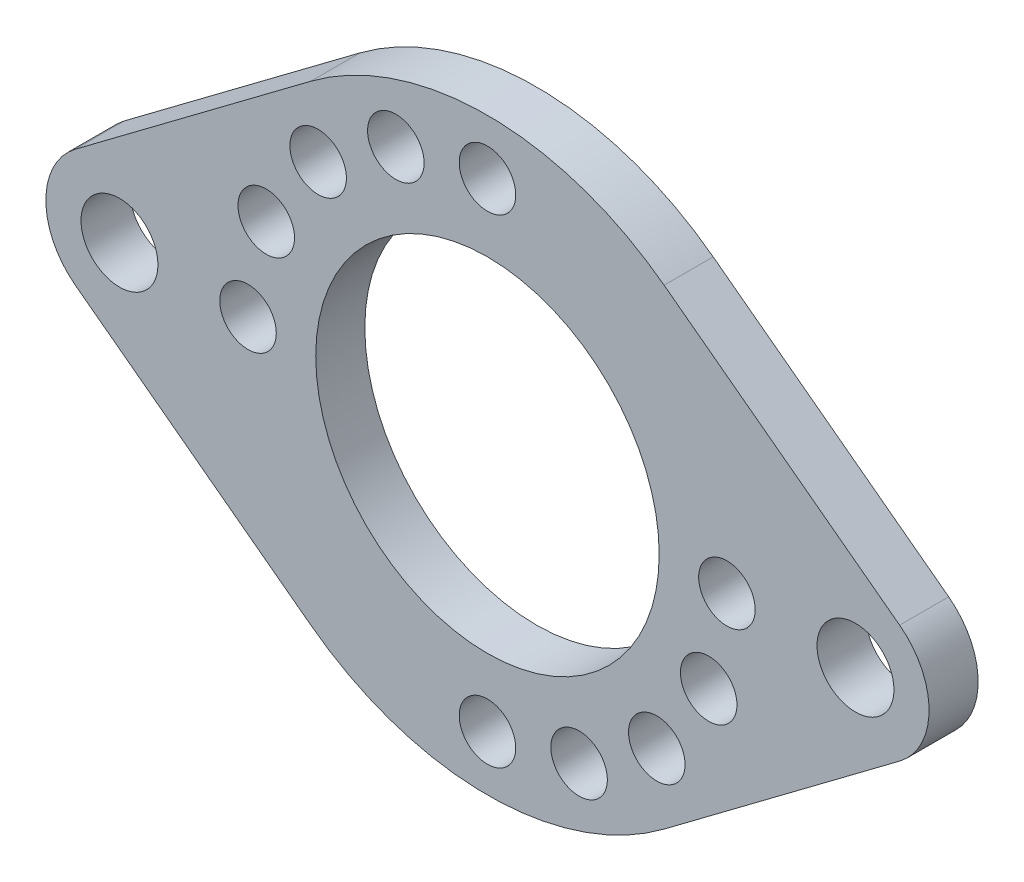
ISO-10303-21;
HEADER;
FILE_DESCRIPTION(('STEP AP214'),'2;1');
FILE_NAME('part.step','',(''),(''),'','','');
FILE_SCHEMA(('AUTOMOTIVE_DESIGN { 1 0 10303 214 1 1 1 1 }'));
ENDSEC;
DATA;
#1=APPLICATION_CONTEXT('core data for automotive mechanical design processes');
#2=APPLICATION_PROTOCOL_DEFINITION('international standard','automotive_design',2000,#1);
#3=PRODUCT_CONTEXT('',#1,'mechanical');
#4=PRODUCT('Part','Part','',(#3));
#5=PRODUCT_RELATED_PRODUCT_CATEGORY('part','',(#4));
#6=PRODUCT_DEFINITION_FORMATION('','',#4);
#7=PRODUCT_DEFINITION_CONTEXT('part definition',#1,'design');
#8=PRODUCT_DEFINITION('design','',#6,#7);
#9=PRODUCT_DEFINITION_SHAPE('','',#8);
#10=(LENGTH_UNIT() NAMED_UNIT(*) SI_UNIT(.MILLI.,.METRE.));
#11=(NAMED_UNIT(*) PLANE_ANGLE_UNIT() SI_UNIT($,.RADIAN.));
#12=(NAMED_UNIT(*) SI_UNIT($,.STERADIAN.) SOLID_ANGLE_UNIT());
#13=UNCERTAINTY_MEASURE_WITH_UNIT(LENGTH_MEASURE(1.E-05),#10,'distance_accuracy_value','');
#14=(GEOMETRIC_REPRESENTATION_CONTEXT(3) GLOBAL_UNCERTAINTY_ASSIGNED_CONTEXT((#13)) GLOBAL_UNIT_ASSIGNED_CONTEXT((#10,
#11,#12)) REPRESENTATION_CONTEXT('',''));
#15=CARTESIAN_POINT('',(0.,0.,0.));
#16=DIRECTION('',(0.,0.,1.));
#17=DIRECTION('',(1.,0.,0.));
#18=AXIS2_PLACEMENT_3D('',#15,#16,#17);
#19=CARTESIAN_POINT('',(0.,0.,-1.5875));
#20=DIRECTION('',(0.,0.,1.));
#21=DIRECTION('',(1.,0.,0.));
#22=AXIS2_PLACEMENT_3D('',#19,#20,#21);
#23=PLANE('',#22);
#24=CARTESIAN_POINT('',(0.,0.,-1.5875));
#25=DIRECTION('',(0.,0.,-1.));
#26=DIRECTION('',(-1.,0.,0.));
#27=AXIS2_PLACEMENT_3D('',#24,#25,#26);
#28=CIRCLE('',#27,11.1125);
#29=CARTESIAN_POINT('',(-11.1125,0.,-1.5875));
#30=VERTEX_POINT('',#29);
#31=EDGE_CURVE('E168',#30,#30,#28,.F.);
#32=ORIENTED_EDGE('',*,*,#31,.T.);
#33=EDGE_LOOP('',(#32));
#34=FACE_BOUND('',#33,.T.);
#35=CARTESIAN_POINT('',(-23.8125,0.,-1.5875));
#36=DIRECTION('',(0.,0.,-1.));
#37=DIRECTION('',(-1.,0.,0.));
#38=AXIS2_PLACEMENT_3D('',#35,#36,#37);
#39=CIRCLE('',#38,4.7625);
#40=CARTESIAN_POINT('',(-26.67,3.81,-1.5875));
#41=VERTEX_POINT('',#40);
#42=CARTESIAN_POINT('',(-26.67,-3.81,-1.5875));
#43=VERTEX_POINT('',#42);
#44=EDGE_CURVE('E172',#41,#43,#39,.F.);
#45=ORIENTED_EDGE('',*,*,#44,.F.);
#46=DIRECTION('',(-0.8,-0.6,0.));
#47=VECTOR('',#46,1.);
#48=CARTESIAN_POINT('',(-11.43,15.24,-1.5875));
#49=LINE('',#48,#47);
#50=CARTESIAN_POINT('',(-11.43,15.24,-1.5875));
#51=VERTEX_POINT('',#50);
#52=EDGE_CURVE('E111',#51,#41,#49,.T.);
#53=ORIENTED_EDGE('',*,*,#52,.F.);
#54=CARTESIAN_POINT('',(0.,0.,-1.5875));
#55=DIRECTION('',(0.,0.,-1.));
#56=DIRECTION('',(-1.,0.,0.));
#57=AXIS2_PLACEMENT_3D('',#54,#55,#56);
#58=CIRCLE('',#57,19.05);
#59=CARTESIAN_POINT('',(11.43,15.24,-1.5875));
#60=VERTEX_POINT('',#59);
#61=EDGE_CURVE('E116',#60,#51,#58,.F.);
#62=ORIENTED_EDGE('',*,*,#61,.F.);
#63=DIRECTION('',(0.8,-0.6,0.));
#64=VECTOR('',#63,1.);
#65=CARTESIAN_POINT('',(11.43,15.24,-1.5875));
#66=LINE('',#65,#64);
#67=CARTESIAN_POINT('',(26.67,3.81,-1.5875));
#68=VERTEX_POINT('',#67);
#69=EDGE_CURVE('E115',#60,#68,#66,.T.);
#70=ORIENTED_EDGE('',*,*,#69,.T.);
#71=CARTESIAN_POINT('',(23.8125,0.,-1.5875));
#72=DIRECTION('',(0.,0.,-1.));
#73=DIRECTION('',(-1.,0.,0.));
#74=AXIS2_PLACEMENT_3D('',#71,#72,#73);
#75=CIRCLE('',#74,4.7625);
#76=CARTESIAN_POINT('',(26.67,-3.81,-1.5875));
#77=VERTEX_POINT('',#76);
#78=EDGE_CURVE('E95',#77,#68,#75,.F.);
#79=ORIENTED_EDGE('',*,*,#78,.F.);
#80=DIRECTION('',(-0.8,-0.6,0.));
#81=VECTOR('',#80,1.);
#82=CARTESIAN_POINT('',(11.43,-15.24,-1.5875));
#83=LINE('',#82,#81);
#84=CARTESIAN_POINT('',(11.43,-15.24,-1.5875));
#85=VERTEX_POINT('',#84);
#86=EDGE_CURVE('E92',#77,#85,#83,.T.);
#87=ORIENTED_EDGE('',*,*,#86,.T.);
#88=CARTESIAN_POINT('',(0.,0.,-1.5875));
#89=DIRECTION('',(0.,0.,-1.));
#90=DIRECTION('',(-1.,0.,0.));
#91=AXIS2_PLACEMENT_3D('',#88,#89,#90);
#92=CIRCLE('',#91,19.05);
#93=CARTESIAN_POINT('',(-11.43,-15.24,-1.5875));
#94=VERTEX_POINT('',#93);
#95=EDGE_CURVE('E79',#94,#85,#92,.F.);
#96=ORIENTED_EDGE('',*,*,#95,.F.);
#97=DIRECTION('',(-0.8,0.6,0.));
#98=VECTOR('',#97,1.);
#99=CARTESIAN_POINT('',(-11.43,-15.24,-1.5875));
#100=LINE('',#99,#98);
#101=EDGE_CURVE('E89',#94,#43,#100,.T.);
#102=ORIENTED_EDGE('',*,*,#101,.T.);
#103=EDGE_LOOP('',(#45,#53,#62,#70,#79,#87,#96,#102));
#104=FACE_BOUND('',#103,.T.);
#105=CARTESIAN_POINT('',(0.,15.494,-1.5875));
#106=DIRECTION('',(0.,0.,1.));
#107=DIRECTION('',(1.,0.,0.));
#108=AXIS2_PLACEMENT_3D('',#105,#106,#107);
#109=CIRCLE('',#108,1.82879999999999);
#110=CARTESIAN_POINT('',(1.82879999999999,15.494,-1.5875));
#111=VERTEX_POINT('',#110);
#112=EDGE_CURVE('E110',#111,#111,#109,.T.);
#113=ORIENTED_EDGE('',*,*,#112,.T.);
#114=EDGE_LOOP('',(#113));
#115=FACE_BOUND('',#114,.T.);
#116=CARTESIAN_POINT('',(-15.494,0.,-1.5875));
#117=DIRECTION('',(0.,0.,1.));
#118=DIRECTION('',(1.,0.,0.));
#119=AXIS2_PLACEMENT_3D('',#116,#117,#118);
#120=CIRCLE('',#119,1.82879999999999);
#121=CARTESIAN_POINT('',(-13.6652,0.,-1.5875));
#122=VERTEX_POINT('',#121);
#123=EDGE_CURVE('E180',#122,#122,#120,.T.);
#124=ORIENTED_EDGE('',*,*,#123,.T.);
#125=EDGE_LOOP('',(#124));
#126=FACE_BOUND('',#125,.T.);
#127=CARTESIAN_POINT('',(-14.3145894767299,5.92929710106476,-1.5875));
#128=DIRECTION('',(0.,0.,1.));
#129=DIRECTION('',(1.,0.,0.));
#130=AXIS2_PLACEMENT_3D('',#127,#128,#129);
#131=CIRCLE('',#130,1.82879999999999);
#132=CARTESIAN_POINT('',(-12.4857894767299,5.92929710106476,-1.5875));
#133=VERTEX_POINT('',#132);
#134=EDGE_CURVE('E183',#133,#133,#131,.T.);
#135=ORIENTED_EDGE('',*,*,#134,.T.);
#136=EDGE_LOOP('',(#135));
#137=FACE_BOUND('',#136,.T.);
#138=CARTESIAN_POINT('',(-5.92929710106471,14.3145894767299,-1.5875));
#139=DIRECTION('',(0.,0.,1.));
#140=DIRECTION('',(1.,0.,0.));
#141=AXIS2_PLACEMENT_3D('',#138,#139,#140);
#142=CIRCLE('',#141,1.82879999999999);
#143=CARTESIAN_POINT('',(-4.10049710106472,14.3145894767299,-1.5875));
#144=VERTEX_POINT('',#143);
#145=EDGE_CURVE('E186',#144,#144,#142,.T.);
#146=ORIENTED_EDGE('',*,*,#145,.T.);
#147=EDGE_LOOP('',(#146));
#148=FACE_BOUND('',#147,.T.);
#149=CARTESIAN_POINT('',(-10.9559124677044,10.9559124677043,-1.5875));
#150=DIRECTION('',(0.,0.,1.));
#151=DIRECTION('',(1.,0.,0.));
#152=AXIS2_PLACEMENT_3D('',#149,#150,#151);
#153=CIRCLE('',#152,1.82879999999999);
#154=CARTESIAN_POINT('',(-9.1271124677044,10.9559124677043,-1.5875));
#155=VERTEX_POINT('',#154);
#156=EDGE_CURVE('E189',#155,#155,#153,.T.);
#157=ORIENTED_EDGE('',*,*,#156,.T.);
#158=EDGE_LOOP('',(#157));
#159=FACE_BOUND('',#158,.T.);
#160=CARTESIAN_POINT('',(0.,-15.494,-1.5875));
#161=DIRECTION('',(0.,0.,1.));
#162=DIRECTION('',(1.,0.,0.));
#163=AXIS2_PLACEMENT_3D('',#160,#161,#162);
#164=CIRCLE('',#163,1.82879999999999);
#165=CARTESIAN_POINT('',(1.82879999999999,-15.494,-1.5875));
#166=VERTEX_POINT('',#165);
#167=EDGE_CURVE('E192',#166,#166,#164,.T.);
#168=ORIENTED_EDGE('',*,*,#167,.T.);
#169=EDGE_LOOP('',(#168));
#170=FACE_BOUND('',#169,.T.);
#171=CARTESIAN_POINT('',(15.494,0.,-1.5875));
#172=DIRECTION('',(0.,0.,1.));
#173=DIRECTION('',(1.,0.,0.));
#174=AXIS2_PLACEMENT_3D('',#171,#172,#173);
#175=CIRCLE('',#174,1.82879999999999);
#176=CARTESIAN_POINT('',(17.3228,0.,-1.5875));
#177=VERTEX_POINT('',#176);
#178=EDGE_CURVE('E195',#177,#177,#175,.T.);
#179=ORIENTED_EDGE('',*,*,#178,.T.);
#180=EDGE_LOOP('',(#179));
#181=FACE_BOUND('',#180,.T.);
#182=CARTESIAN_POINT('',(14.3145894767299,-5.92929710106476,-1.5875));
#183=DIRECTION('',(0.,0.,1.));
#184=DIRECTION('',(1.,0.,0.));
#185=AXIS2_PLACEMENT_3D('',#182,#183,#184);
#186=CIRCLE('',#185,1.82879999999999);
#187=CARTESIAN_POINT('',(16.1433894767298,-5.92929710106476,-1.5875));
#188=VERTEX_POINT('',#187);
#189=EDGE_CURVE('E198',#188,#188,#186,.T.);
#190=ORIENTED_EDGE('',*,*,#189,.T.);
#191=EDGE_LOOP('',(#190));
#192=FACE_BOUND('',#191,.T.);
#193=CARTESIAN_POINT('',(5.92929710106471,-14.3145894767299,-1.5875));
#194=DIRECTION('',(0.,0.,1.));
#195=DIRECTION('',(1.,0.,0.));
#196=AXIS2_PLACEMENT_3D('',#193,#194,#195);
#197=CIRCLE('',#196,1.82879999999999);
#198=CARTESIAN_POINT('',(7.7580971010647,-14.3145894767299,-1.5875));
#199=VERTEX_POINT('',#198);
#200=EDGE_CURVE('E201',#199,#199,#197,.T.);
#201=ORIENTED_EDGE('',*,*,#200,.T.);
#202=EDGE_LOOP('',(#201));
#203=FACE_BOUND('',#202,.T.);
#204=CARTESIAN_POINT('',(10.9559124677044,-10.9559124677043,-1.5875));
#205=DIRECTION('',(0.,0.,1.));
#206=DIRECTION('',(1.,0.,0.));
#207=AXIS2_PLACEMENT_3D('',#204,#205,#206);
#208=CIRCLE('',#207,1.82879999999999);
#209=CARTESIAN_POINT('',(12.7847124677044,-10.9559124677043,-1.5875));
#210=VERTEX_POINT('',#209);
#211=EDGE_CURVE('E204',#210,#210,#208,.T.);
#212=ORIENTED_EDGE('',*,*,#211,.T.);
#213=EDGE_LOOP('',(#212));
#214=FACE_BOUND('',#213,.T.);
#215=CARTESIAN_POINT('',(-23.8125,0.,-1.5875));
#216=DIRECTION('',(0.,0.,1.));
#217=DIRECTION('',(1.,0.,0.));
#218=AXIS2_PLACEMENT_3D('',#215,#216,#217);
#219=CIRCLE('',#218,2.48919999999999);
#220=CARTESIAN_POINT('',(-21.3233,0.,-1.5875));
#221=VERTEX_POINT('',#220);
#222=EDGE_CURVE('E206',#221,#221,#219,.T.);
#223=ORIENTED_EDGE('',*,*,#222,.T.);
#224=EDGE_LOOP('',(#223));
#225=FACE_BOUND('',#224,.T.);
#226=CARTESIAN_POINT('',(23.8125,0.,-1.5875));
#227=DIRECTION('',(0.,0.,1.));
#228=DIRECTION('',(1.,0.,0.));
#229=AXIS2_PLACEMENT_3D('',#226,#227,#228);
#230=CIRCLE('',#229,2.48919999999999);
#231=CARTESIAN_POINT('',(26.3017,0.,-1.5875));
#232=VERTEX_POINT('',#231);
#233=EDGE_CURVE('E20',#232,#232,#230,.T.);
#234=ORIENTED_EDGE('',*,*,#233,.T.);
#235=EDGE_LOOP('',(#234));
#236=FACE_BOUND('',#235,.T.);
#237=ADVANCED_FACE('F17',(#34,#104,#115,#126,#137,#148,#159,#170,#181,#192,#203,#214,#225,#236),
#23,.F.);
#238=CARTESIAN_POINT('',(23.8125,0.,1.5875));
#239=DIRECTION('',(0.,0.,1.));
#240=DIRECTION('',(1.,0.,0.));
#241=AXIS2_PLACEMENT_3D('',#238,#239,#240);
#242=CYLINDRICAL_SURFACE('',#241,2.48919999999999);
#243=CARTESIAN_POINT('',(23.8125,0.,1.5875));
#244=DIRECTION('',(0.,0.,1.));
#245=DIRECTION('',(1.,0.,0.));
#246=AXIS2_PLACEMENT_3D('',#243,#244,#245);
#247=CIRCLE('',#246,2.48919999999999);
#248=CARTESIAN_POINT('',(26.3017,0.,1.5875));
#249=VERTEX_POINT('',#248);
#250=EDGE_CURVE('E165',#249,#249,#247,.F.);
#251=ORIENTED_EDGE('',*,*,#250,.F.);
#252=EDGE_LOOP('',(#251));
#253=FACE_BOUND('',#252,.T.);
#254=ORIENTED_EDGE('',*,*,#233,.F.);
#255=EDGE_LOOP('',(#254));
#256=FACE_BOUND('',#255,.T.);
#257=ADVANCED_FACE('F214',(#253,#256),#242,.F.);
#258=CARTESIAN_POINT('',(-23.8125,0.,1.5875));
#259=DIRECTION('',(0.,0.,1.));
#260=DIRECTION('',(1.,0.,0.));
#261=AXIS2_PLACEMENT_3D('',#258,#259,#260);
#262=CYLINDRICAL_SURFACE('',#261,2.48919999999999);
#263=CARTESIAN_POINT('',(-23.8125,0.,1.5875));
#264=DIRECTION('',(0.,0.,1.));
#265=DIRECTION('',(1.,0.,0.));
#266=AXIS2_PLACEMENT_3D('',#263,#264,#265);
#267=CIRCLE('',#266,2.48919999999999);
#268=CARTESIAN_POINT('',(-21.3233,0.,1.5875));
#269=VERTEX_POINT('',#268);
#270=EDGE_CURVE('E162',#269,#269,#267,.F.);
#271=ORIENTED_EDGE('',*,*,#270,.F.);
#272=EDGE_LOOP('',(#271));
#273=FACE_BOUND('',#272,.T.);
#274=ORIENTED_EDGE('',*,*,#222,.F.);
#275=EDGE_LOOP('',(#274));
#276=FACE_BOUND('',#275,.T.);
#277=ADVANCED_FACE('F216',(#273,#276),#262,.F.);
#278=CARTESIAN_POINT('',(10.9559124677044,-10.9559124677043,1.5875));
#279=DIRECTION('',(0.,0.,1.));
#280=DIRECTION('',(1.,0.,0.));
#281=AXIS2_PLACEMENT_3D('',#278,#279,#280);
#282=CYLINDRICAL_SURFACE('',#281,1.82879999999999);
#283=CARTESIAN_POINT('',(10.9559124677044,-10.9559124677043,1.5875));
#284=DIRECTION('',(0.,0.,1.));
#285=DIRECTION('',(1.,0.,0.));
#286=AXIS2_PLACEMENT_3D('',#283,#284,#285);
#287=CIRCLE('',#286,1.82879999999999);
#288=CARTESIAN_POINT('',(12.7847124677044,-10.9559124677043,1.5875));
#289=VERTEX_POINT('',#288);
#290=EDGE_CURVE('E159',#289,#289,#287,.F.);
#291=ORIENTED_EDGE('',*,*,#290,.F.);
#292=EDGE_LOOP('',(#291));
#293=FACE_BOUND('',#292,.T.);
#294=ORIENTED_EDGE('',*,*,#211,.F.);
#295=EDGE_LOOP('',(#294));
#296=FACE_BOUND('',#295,.T.);
#297=ADVANCED_FACE('F223',(#293,#296),#282,.F.);
#298=CARTESIAN_POINT('',(5.92929710106471,-14.3145894767299,1.5875));
#299=DIRECTION('',(0.,0.,1.));
#300=DIRECTION('',(1.,0.,0.));
#301=AXIS2_PLACEMENT_3D('',#298,#299,#300);
#302=CYLINDRICAL_SURFACE('',#301,1.82879999999999);
#303=CARTESIAN_POINT('',(5.92929710106471,-14.3145894767299,1.5875));
#304=DIRECTION('',(0.,0.,1.));
#305=DIRECTION('',(1.,0.,0.));
#306=AXIS2_PLACEMENT_3D('',#303,#304,#305);
#307=CIRCLE('',#306,1.82879999999999);
#308=CARTESIAN_POINT('',(7.7580971010647,-14.3145894767299,1.5875));
#309=VERTEX_POINT('',#308);
#310=EDGE_CURVE('E156',#309,#309,#307,.F.);
#311=ORIENTED_EDGE('',*,*,#310,.F.);
#312=EDGE_LOOP('',(#311));
#313=FACE_BOUND('',#312,.T.);
#314=ORIENTED_EDGE('',*,*,#200,.F.);
#315=EDGE_LOOP('',(#314));
#316=FACE_BOUND('',#315,.T.);
#317=ADVANCED_FACE('F298',(#313,#316),#302,.F.);
#318=CARTESIAN_POINT('',(14.3145894767299,-5.92929710106476,1.5875));
#319=DIRECTION('',(0.,0.,1.));
#320=DIRECTION('',(1.,0.,0.));
#321=AXIS2_PLACEMENT_3D('',#318,#319,#320);
#322=CYLINDRICAL_SURFACE('',#321,1.82879999999999);
#323=CARTESIAN_POINT('',(14.3145894767299,-5.92929710106476,1.5875));
#324=DIRECTION('',(0.,0.,1.));
#325=DIRECTION('',(1.,0.,0.));
#326=AXIS2_PLACEMENT_3D('',#323,#324,#325);
#327=CIRCLE('',#326,1.82879999999999);
#328=CARTESIAN_POINT('',(16.1433894767298,-5.92929710106476,1.5875));
#329=VERTEX_POINT('',#328);
#330=EDGE_CURVE('E153',#329,#329,#327,.F.);
#331=ORIENTED_EDGE('',*,*,#330,.F.);
#332=EDGE_LOOP('',(#331));
#333=FACE_BOUND('',#332,.T.);
#334=ORIENTED_EDGE('',*,*,#189,.F.);
#335=EDGE_LOOP('',(#334));
#336=FACE_BOUND('',#335,.T.);
#337=ADVANCED_FACE('F294',(#333,#336),#322,.F.);
#338=CARTESIAN_POINT('',(15.494,0.,1.5875));
#339=DIRECTION('',(0.,0.,1.));
#340=DIRECTION('',(1.,0.,0.));
#341=AXIS2_PLACEMENT_3D('',#338,#339,#340);
#342=CYLINDRICAL_SURFACE('',#341,1.82879999999999);
#343=CARTESIAN_POINT('',(15.494,0.,1.5875));
#344=DIRECTION('',(0.,0.,1.));
#345=DIRECTION('',(1.,0.,0.));
#346=AXIS2_PLACEMENT_3D('',#343,#344,#345);
#347=CIRCLE('',#346,1.82879999999999);
#348=CARTESIAN_POINT('',(17.3228,0.,1.5875));
#349=VERTEX_POINT('',#348);
#350=EDGE_CURVE('E150',#349,#349,#347,.F.);
#351=ORIENTED_EDGE('',*,*,#350,.F.);
#352=EDGE_LOOP('',(#351));
#353=FACE_BOUND('',#352,.T.);
#354=ORIENTED_EDGE('',*,*,#178,.F.);
#355=EDGE_LOOP('',(#354));
#356=FACE_BOUND('',#355,.T.);
#357=ADVANCED_FACE('F290',(#353,#356),#342,.F.);
#358=CARTESIAN_POINT('',(0.,-15.494,1.5875));
#359=DIRECTION('',(0.,0.,1.));
#360=DIRECTION('',(1.,0.,0.));
#361=AXIS2_PLACEMENT_3D('',#358,#359,#360);
#362=CYLINDRICAL_SURFACE('',#361,1.82879999999999);
#363=CARTESIAN_POINT('',(0.,-15.494,1.5875));
#364=DIRECTION('',(0.,0.,1.));
#365=DIRECTION('',(1.,0.,0.));
#366=AXIS2_PLACEMENT_3D('',#363,#364,#365);
#367=CIRCLE('',#366,1.82879999999999);
#368=CARTESIAN_POINT('',(1.82879999999999,-15.494,1.5875));
#369=VERTEX_POINT('',#368);
#370=EDGE_CURVE('E147',#369,#369,#367,.F.);
#371=ORIENTED_EDGE('',*,*,#370,.F.);
#372=EDGE_LOOP('',(#371));
#373=FACE_BOUND('',#372,.T.);
#374=ORIENTED_EDGE('',*,*,#167,.F.);
#375=EDGE_LOOP('',(#374));
#376=FACE_BOUND('',#375,.T.);
#377=ADVANCED_FACE('F286',(#373,#376),#362,.F.);
#378=CARTESIAN_POINT('',(-10.9559124677044,10.9559124677043,1.5875));
#379=DIRECTION('',(0.,0.,1.));
#380=DIRECTION('',(1.,0.,0.));
#381=AXIS2_PLACEMENT_3D('',#378,#379,#380);
#382=CYLINDRICAL_SURFACE('',#381,1.82879999999999);
#383=CARTESIAN_POINT('',(-10.9559124677044,10.9559124677043,1.5875));
#384=DIRECTION('',(0.,0.,1.));
#385=DIRECTION('',(1.,0.,0.));
#386=AXIS2_PLACEMENT_3D('',#383,#384,#385);
#387=CIRCLE('',#386,1.82879999999999);
#388=CARTESIAN_POINT('',(-9.1271124677044,10.9559124677043,1.5875));
#389=VERTEX_POINT('',#388);
#390=EDGE_CURVE('E144',#389,#389,#387,.F.);
#391=ORIENTED_EDGE('',*,*,#390,.F.);
#392=EDGE_LOOP('',(#391));
#393=FACE_BOUND('',#392,.T.);
#394=ORIENTED_EDGE('',*,*,#156,.F.);
#395=EDGE_LOOP('',(#394));
#396=FACE_BOUND('',#395,.T.);
#397=ADVANCED_FACE('F282',(#393,#396),#382,.F.);
#398=CARTESIAN_POINT('',(-5.92929710106471,14.3145894767299,1.5875));
#399=DIRECTION('',(0.,0.,1.));
#400=DIRECTION('',(1.,0.,0.));
#401=AXIS2_PLACEMENT_3D('',#398,#399,#400);
#402=CYLINDRICAL_SURFACE('',#401,1.82879999999999);
#403=CARTESIAN_POINT('',(-5.92929710106471,14.3145894767299,1.5875));
#404=DIRECTION('',(0.,0.,1.));
#405=DIRECTION('',(1.,0.,0.));
#406=AXIS2_PLACEMENT_3D('',#403,#404,#405);
#407=CIRCLE('',#406,1.82879999999999);
#408=CARTESIAN_POINT('',(-4.10049710106472,14.3145894767299,1.5875));
#409=VERTEX_POINT('',#408);
#410=EDGE_CURVE('E141',#409,#409,#407,.F.);
#411=ORIENTED_EDGE('',*,*,#410,.F.);
#412=EDGE_LOOP('',(#411));
#413=FACE_BOUND('',#412,.T.);
#414=ORIENTED_EDGE('',*,*,#145,.F.);
#415=EDGE_LOOP('',(#414));
#416=FACE_BOUND('',#415,.T.);
#417=ADVANCED_FACE('F278',(#413,#416),#402,.F.);
#418=CARTESIAN_POINT('',(-14.3145894767299,5.92929710106476,1.5875));
#419=DIRECTION('',(0.,0.,1.));
#420=DIRECTION('',(1.,0.,0.));
#421=AXIS2_PLACEMENT_3D('',#418,#419,#420);
#422=CYLINDRICAL_SURFACE('',#421,1.82879999999999);
#423=CARTESIAN_POINT('',(-14.3145894767299,5.92929710106476,1.5875));
#424=DIRECTION('',(0.,0.,1.));
#425=DIRECTION('',(1.,0.,0.));
#426=AXIS2_PLACEMENT_3D('',#423,#424,#425);
#427=CIRCLE('',#426,1.82879999999999);
#428=CARTESIAN_POINT('',(-12.4857894767299,5.92929710106476,1.5875));
#429=VERTEX_POINT('',#428);
#430=EDGE_CURVE('E138',#429,#429,#427,.F.);
#431=ORIENTED_EDGE('',*,*,#430,.F.);
#432=EDGE_LOOP('',(#431));
#433=FACE_BOUND('',#432,.T.);
#434=ORIENTED_EDGE('',*,*,#134,.F.);
#435=EDGE_LOOP('',(#434));
#436=FACE_BOUND('',#435,.T.);
#437=ADVANCED_FACE('F274',(#433,#436),#422,.F.);
#438=CARTESIAN_POINT('',(-15.494,0.,1.5875));
#439=DIRECTION('',(0.,0.,1.));
#440=DIRECTION('',(1.,0.,0.));
#441=AXIS2_PLACEMENT_3D('',#438,#439,#440);
#442=CYLINDRICAL_SURFACE('',#441,1.82879999999999);
#443=CARTESIAN_POINT('',(-15.494,0.,1.5875));
#444=DIRECTION('',(0.,0.,1.));
#445=DIRECTION('',(1.,0.,0.));
#446=AXIS2_PLACEMENT_3D('',#443,#444,#445);
#447=CIRCLE('',#446,1.82879999999999);
#448=CARTESIAN_POINT('',(-13.6652,0.,1.5875));
#449=VERTEX_POINT('',#448);
#450=EDGE_CURVE('E135',#449,#449,#447,.F.);
#451=ORIENTED_EDGE('',*,*,#450,.F.);
#452=EDGE_LOOP('',(#451));
#453=FACE_BOUND('',#452,.T.);
#454=ORIENTED_EDGE('',*,*,#123,.F.);
#455=EDGE_LOOP('',(#454));
#456=FACE_BOUND('',#455,.T.);
#457=ADVANCED_FACE('F270',(#453,#456),#442,.F.);
#458=CARTESIAN_POINT('',(0.,15.494,1.5875));
#459=DIRECTION('',(0.,0.,1.));
#460=DIRECTION('',(1.,0.,0.));
#461=AXIS2_PLACEMENT_3D('',#458,#459,#460);
#462=CYLINDRICAL_SURFACE('',#461,1.82879999999999);
#463=CARTESIAN_POINT('',(0.,15.494,1.5875));
#464=DIRECTION('',(0.,0.,1.));
#465=DIRECTION('',(1.,0.,0.));
#466=AXIS2_PLACEMENT_3D('',#463,#464,#465);
#467=CIRCLE('',#466,1.82879999999999);
#468=CARTESIAN_POINT('',(1.82879999999999,15.494,1.5875));
#469=VERTEX_POINT('',#468);
#470=EDGE_CURVE('E132',#469,#469,#467,.F.);
#471=ORIENTED_EDGE('',*,*,#470,.F.);
#472=EDGE_LOOP('',(#471));
#473=FACE_BOUND('',#472,.T.);
#474=ORIENTED_EDGE('',*,*,#112,.F.);
#475=EDGE_LOOP('',(#474));
#476=FACE_BOUND('',#475,.T.);
#477=ADVANCED_FACE('F266',(#473,#476),#462,.F.);
#478=CARTESIAN_POINT('',(-11.43,-15.24,1.5875));
#479=DIRECTION('',(0.6,0.8,0.));
#480=DIRECTION('',(-0.8,0.6,0.));
#481=AXIS2_PLACEMENT_3D('',#478,#479,#480);
#482=PLANE('',#481);
#483=DIRECTION('',(0.,0.,-1.));
#484=VECTOR('',#483,1.);
#485=CARTESIAN_POINT('',(-11.43,-15.24,1.5875));
#486=LINE('',#485,#484);
#487=CARTESIAN_POINT('',(-11.43,-15.24,1.5875));
#488=VERTEX_POINT('',#487);
#489=EDGE_CURVE('E88',#488,#94,#486,.T.);
#490=ORIENTED_EDGE('',*,*,#489,.F.);
#491=DIRECTION('',(0.8,-0.6,0.));
#492=VECTOR('',#491,1.);
#493=CARTESIAN_POINT('',(-26.67,-3.81,1.5875));
#494=LINE('',#493,#492);
#495=CARTESIAN_POINT('',(-26.67,-3.81,1.5875));
#496=VERTEX_POINT('',#495);
#497=EDGE_CURVE('E131',#496,#488,#494,.T.);
#498=ORIENTED_EDGE('',*,*,#497,.F.);
#499=DIRECTION('',(0.,0.,-1.));
#500=VECTOR('',#499,1.);
#501=CARTESIAN_POINT('',(-26.67,-3.81,1.5875));
#502=LINE('',#501,#500);
#503=EDGE_CURVE('E171',#43,#496,#502,.F.);
#504=ORIENTED_EDGE('',*,*,#503,.F.);
#505=ORIENTED_EDGE('',*,*,#101,.F.);
#506=EDGE_LOOP('',(#490,#498,#504,#505));
#507=FACE_BOUND('',#506,.T.);
#508=ADVANCED_FACE('F263',(#507),#482,.F.);
#509=CARTESIAN_POINT('',(0.,0.,1.5875));
#510=DIRECTION('',(0.,0.,-1.));
#511=DIRECTION('',(-1.,0.,0.));
#512=AXIS2_PLACEMENT_3D('',#509,#510,#511);
#513=CYLINDRICAL_SURFACE('',#512,19.05);
#514=CARTESIAN_POINT('',(0.,0.,1.5875));
#515=DIRECTION('',(0.,0.,-1.));
#516=DIRECTION('',(-1.,0.,0.));
#517=AXIS2_PLACEMENT_3D('',#514,#515,#516);
#518=CIRCLE('',#517,19.05);
#519=CARTESIAN_POINT('',(11.43,-15.24,1.5875));
#520=VERTEX_POINT('',#519);
#521=EDGE_CURVE('E129',#488,#520,#518,.F.);
#522=ORIENTED_EDGE('',*,*,#521,.F.);
#523=ORIENTED_EDGE('',*,*,#489,.T.);
#524=ORIENTED_EDGE('',*,*,#95,.T.);
#525=DIRECTION('',(0.,0.,1.));
#526=VECTOR('',#525,1.);
#527=CARTESIAN_POINT('',(11.43,-15.24,1.5875));
#528=LINE('',#527,#526);
#529=EDGE_CURVE('E86',#85,#520,#528,.T.);
#530=ORIENTED_EDGE('',*,*,#529,.T.);
#531=EDGE_LOOP('',(#522,#523,#524,#530));
#532=FACE_BOUND('',#531,.T.);
#533=ADVANCED_FACE('F84',(#532),#513,.T.);
#534=CARTESIAN_POINT('',(11.43,-15.24,1.5875));
#535=DIRECTION('',(-0.6,0.8,0.));
#536=DIRECTION('',(-0.8,-0.6,0.));
#537=AXIS2_PLACEMENT_3D('',#534,#535,#536);
#538=PLANE('',#537);
#539=DIRECTION('',(0.,0.,-1.));
#540=VECTOR('',#539,1.);
#541=CARTESIAN_POINT('',(26.67,-3.81,1.5875));
#542=LINE('',#541,#540);
#543=CARTESIAN_POINT('',(26.67,-3.81,1.5875));
#544=VERTEX_POINT('',#543);
#545=EDGE_CURVE('E106',#544,#77,#542,.T.);
#546=ORIENTED_EDGE('',*,*,#545,.F.);
#547=DIRECTION('',(0.8,0.6,0.));
#548=VECTOR('',#547,1.);
#549=CARTESIAN_POINT('',(11.43,-15.24,1.5875));
#550=LINE('',#549,#548);
#551=EDGE_CURVE('E101',#520,#544,#550,.T.);
#552=ORIENTED_EDGE('',*,*,#551,.F.);
#553=ORIENTED_EDGE('',*,*,#529,.F.);
#554=ORIENTED_EDGE('',*,*,#86,.F.);
#555=EDGE_LOOP('',(#546,#552,#553,#554));
#556=FACE_BOUND('',#555,.T.);
#557=ADVANCED_FACE('F99',(#556),#538,.F.);
#558=CARTESIAN_POINT('',(23.8125,0.,1.5875));
#559=DIRECTION('',(0.,0.,-1.));
#560=DIRECTION('',(-1.,0.,0.));
#561=AXIS2_PLACEMENT_3D('',#558,#559,#560);
#562=CYLINDRICAL_SURFACE('',#561,4.7625);
#563=CARTESIAN_POINT('',(23.8125,0.,1.5875));
#564=DIRECTION('',(0.,0.,-1.));
#565=DIRECTION('',(-1.,0.,0.));
#566=AXIS2_PLACEMENT_3D('',#563,#564,#565);
#567=CIRCLE('',#566,4.7625);
#568=CARTESIAN_POINT('',(26.67,3.81,1.5875));
#569=VERTEX_POINT('',#568);
#570=EDGE_CURVE('E126',#544,#569,#567,.F.);
#571=ORIENTED_EDGE('',*,*,#570,.F.);
#572=ORIENTED_EDGE('',*,*,#545,.T.);
#573=ORIENTED_EDGE('',*,*,#78,.T.);
#574=DIRECTION('',(0.,0.,1.));
#575=VECTOR('',#574,1.);
#576=CARTESIAN_POINT('',(26.67,3.81,1.5875));
#577=LINE('',#576,#575);
#578=EDGE_CURVE('E117',#68,#569,#577,.T.);
#579=ORIENTED_EDGE('',*,*,#578,.T.);
#580=EDGE_LOOP('',(#571,#572,#573,#579));
#581=FACE_BOUND('',#580,.T.);
#582=ADVANCED_FACE('F254',(#581),#562,.T.);
#583=CARTESIAN_POINT('',(11.43,15.24,1.5875));
#584=DIRECTION('',(-0.6,-0.8,0.));
#585=DIRECTION('',(0.8,-0.6,0.));
#586=AXIS2_PLACEMENT_3D('',#583,#584,#585);
#587=PLANE('',#586);
#588=DIRECTION('',(0.,0.,-1.));
#589=VECTOR('',#588,1.);
#590=CARTESIAN_POINT('',(11.43,15.24,1.5875));
#591=LINE('',#590,#589);
#592=CARTESIAN_POINT('',(11.43,15.24,1.5875));
#593=VERTEX_POINT('',#592);
#594=EDGE_CURVE('E114',#593,#60,#591,.T.);
#595=ORIENTED_EDGE('',*,*,#594,.F.);
#596=DIRECTION('',(-0.8,0.6,0.));
#597=VECTOR('',#596,1.);
#598=CARTESIAN_POINT('',(26.67,3.81,1.5875));
#599=LINE('',#598,#597);
#600=EDGE_CURVE('E125',#569,#593,#599,.T.);
#601=ORIENTED_EDGE('',*,*,#600,.F.);
#602=ORIENTED_EDGE('',*,*,#578,.F.);
#603=ORIENTED_EDGE('',*,*,#69,.F.);
#604=EDGE_LOOP('',(#595,#601,#602,#603));
#605=FACE_BOUND('',#604,.T.);
#606=ADVANCED_FACE('F250',(#605),#587,.F.);
#607=CARTESIAN_POINT('',(0.,0.,1.5875));
#608=DIRECTION('',(0.,0.,-1.));
#609=DIRECTION('',(-1.,0.,0.));
#610=AXIS2_PLACEMENT_3D('',#607,#608,#609);
#611=CYLINDRICAL_SURFACE('',#610,19.05);
#612=CARTESIAN_POINT('',(0.,0.,1.5875));
#613=DIRECTION('',(0.,0.,-1.));
#614=DIRECTION('',(-1.,0.,0.));
#615=AXIS2_PLACEMENT_3D('',#612,#613,#614);
#616=CIRCLE('',#615,19.05);
#617=CARTESIAN_POINT('',(-11.43,15.24,1.5875));
#618=VERTEX_POINT('',#617);
#619=EDGE_CURVE('E122',#593,#618,#616,.F.);
#620=ORIENTED_EDGE('',*,*,#619,.F.);
#621=ORIENTED_EDGE('',*,*,#594,.T.);
#622=ORIENTED_EDGE('',*,*,#61,.T.);
#623=DIRECTION('',(0.,0.,1.));
#624=VECTOR('',#623,1.);
#625=CARTESIAN_POINT('',(-11.43,15.24,1.5875));
#626=LINE('',#625,#624);
#627=EDGE_CURVE('E113',#618,#51,#626,.F.);
#628=ORIENTED_EDGE('',*,*,#627,.F.);
#629=EDGE_LOOP('',(#620,#621,#622,#628));
#630=FACE_BOUND('',#629,.T.);
#631=ADVANCED_FACE('F247',(#630),#611,.T.);
#632=CARTESIAN_POINT('',(-11.43,15.24,1.5875));
#633=DIRECTION('',(-0.6,0.8,0.));
#634=DIRECTION('',(-0.8,-0.6,0.));
#635=AXIS2_PLACEMENT_3D('',#632,#633,#634);
#636=PLANE('',#635);
#637=DIRECTION('',(-0.8,-0.6,0.));
#638=VECTOR('',#637,1.);
#639=CARTESIAN_POINT('',(-11.43,15.24,1.5875));
#640=LINE('',#639,#638);
#641=CARTESIAN_POINT('',(-26.67,3.81,1.5875));
#642=VERTEX_POINT('',#641);
#643=EDGE_CURVE('E121',#618,#642,#640,.T.);
#644=ORIENTED_EDGE('',*,*,#643,.F.);
#645=ORIENTED_EDGE('',*,*,#627,.T.);
#646=ORIENTED_EDGE('',*,*,#52,.T.);
#647=DIRECTION('',(0.,0.,-1.));
#648=VECTOR('',#647,1.);
#649=CARTESIAN_POINT('',(-26.67,3.81,1.5875));
#650=LINE('',#649,#648);
#651=EDGE_CURVE('E35',#642,#41,#650,.T.);
#652=ORIENTED_EDGE('',*,*,#651,.F.);
#653=EDGE_LOOP('',(#644,#645,#646,#652));
#654=FACE_BOUND('',#653,.T.);
#655=ADVANCED_FACE('F243',(#654),#636,.T.);
#656=CARTESIAN_POINT('',(-23.8125,0.,1.5875));
#657=DIRECTION('',(0.,0.,-1.));
#658=DIRECTION('',(-1.,0.,0.));
#659=AXIS2_PLACEMENT_3D('',#656,#657,#658);
#660=CYLINDRICAL_SURFACE('',#659,4.7625);
#661=ORIENTED_EDGE('',*,*,#44,.T.);
#662=ORIENTED_EDGE('',*,*,#503,.T.);
#663=CARTESIAN_POINT('',(-23.8125,0.,1.5875));
#664=DIRECTION('',(0.,0.,-1.));
#665=DIRECTION('',(-1.,0.,0.));
#666=AXIS2_PLACEMENT_3D('',#663,#664,#665);
#667=CIRCLE('',#666,4.7625);
#668=EDGE_CURVE('E26',#642,#496,#667,.F.);
#669=ORIENTED_EDGE('',*,*,#668,.F.);
#670=ORIENTED_EDGE('',*,*,#651,.T.);
#671=EDGE_LOOP('',(#661,#662,#669,#670));
#672=FACE_BOUND('',#671,.T.);
#673=ADVANCED_FACE('F236',(#672),#660,.T.);
#674=CARTESIAN_POINT('',(0.,0.,1.5875));
#675=DIRECTION('',(0.,0.,-1.));
#676=DIRECTION('',(-1.,0.,0.));
#677=AXIS2_PLACEMENT_3D('',#674,#675,#676);
#678=CYLINDRICAL_SURFACE('',#677,11.1125);
#679=CARTESIAN_POINT('',(0.,0.,1.5875));
#680=DIRECTION('',(0.,0.,-1.));
#681=DIRECTION('',(-1.,0.,0.));
#682=AXIS2_PLACEMENT_3D('',#679,#680,#681);
#683=CIRCLE('',#682,11.1125);
#684=CARTESIAN_POINT('',(-11.1125,0.,1.5875));
#685=VERTEX_POINT('',#684);
#686=EDGE_CURVE('E11',#685,#685,#683,.T.);
#687=ORIENTED_EDGE('',*,*,#686,.F.);
#688=EDGE_LOOP('',(#687));
#689=FACE_BOUND('',#688,.T.);
#690=ORIENTED_EDGE('',*,*,#31,.F.);
#691=EDGE_LOOP('',(#690));
#692=FACE_BOUND('',#691,.T.);
#693=ADVANCED_FACE('F230',(#689,#692),#678,.F.);
#694=CARTESIAN_POINT('',(0.,0.,1.5875));
#695=DIRECTION('',(0.,0.,1.));
#696=DIRECTION('',(1.,0.,0.));
#697=AXIS2_PLACEMENT_3D('',#694,#695,#696);
#698=PLANE('',#697);
#699=ORIENTED_EDGE('',*,*,#686,.T.);
#700=EDGE_LOOP('',(#699));
#701=FACE_BOUND('',#700,.T.);
#702=ORIENTED_EDGE('',*,*,#668,.T.);
#703=ORIENTED_EDGE('',*,*,#497,.T.);
#704=ORIENTED_EDGE('',*,*,#521,.T.);
#705=ORIENTED_EDGE('',*,*,#551,.T.);
#706=ORIENTED_EDGE('',*,*,#570,.T.);
#707=ORIENTED_EDGE('',*,*,#600,.T.);
#708=ORIENTED_EDGE('',*,*,#619,.T.);
#709=ORIENTED_EDGE('',*,*,#643,.T.);
#710=EDGE_LOOP('',(#702,#703,#704,#705,#706,#707,#708,#709));
#711=FACE_BOUND('',#710,.T.);
#712=ORIENTED_EDGE('',*,*,#470,.T.);
#713=EDGE_LOOP('',(#712));
#714=FACE_BOUND('',#713,.T.);
#715=ORIENTED_EDGE('',*,*,#450,.T.);
#716=EDGE_LOOP('',(#715));
#717=FACE_BOUND('',#716,.T.);
#718=ORIENTED_EDGE('',*,*,#430,.T.);
#719=EDGE_LOOP('',(#718));
#720=FACE_BOUND('',#719,.T.);
#721=ORIENTED_EDGE('',*,*,#410,.T.);
#722=EDGE_LOOP('',(#721));
#723=FACE_BOUND('',#722,.T.);
#724=ORIENTED_EDGE('',*,*,#390,.T.);
#725=EDGE_LOOP('',(#724));
#726=FACE_BOUND('',#725,.T.);
#727=ORIENTED_EDGE('',*,*,#370,.T.);
#728=EDGE_LOOP('',(#727));
#729=FACE_BOUND('',#728,.T.);
#730=ORIENTED_EDGE('',*,*,#350,.T.);
#731=EDGE_LOOP('',(#730));
#732=FACE_BOUND('',#731,.T.);
#733=ORIENTED_EDGE('',*,*,#330,.T.);
#734=EDGE_LOOP('',(#733));
#735=FACE_BOUND('',#734,.T.);
#736=ORIENTED_EDGE('',*,*,#310,.T.);
#737=EDGE_LOOP('',(#736));
#738=FACE_BOUND('',#737,.T.);
#739=ORIENTED_EDGE('',*,*,#290,.T.);
#740=EDGE_LOOP('',(#739));
#741=FACE_BOUND('',#740,.T.);
#742=ORIENTED_EDGE('',*,*,#270,.T.);
#743=EDGE_LOOP('',(#742));
#744=FACE_BOUND('',#743,.T.);
#745=ORIENTED_EDGE('',*,*,#250,.T.);
#746=EDGE_LOOP('',(#745));
#747=FACE_BOUND('',#746,.T.);
#748=ADVANCED_FACE('F228',(#701,#711,#714,#717,#720,#723,#726,#729,#732,#735,#738,#741,#744,
#747),#698,.T.);
#749=CLOSED_SHELL('',(#237,#257,#277,#297,#317,#337,#357,#377,#397,#417,#437,#457,#477,#508,
#533,#557,#582,#606,#631,#655,#673,#693,#748));
#750=MANIFOLD_SOLID_BREP('B1',#749);
#751=ADVANCED_BREP_SHAPE_REPRESENTATION('',(#18,#750),#14);
#752=SHAPE_DEFINITION_REPRESENTATION(#9,#751);
ENDSEC;
END-ISO-10303-21;
